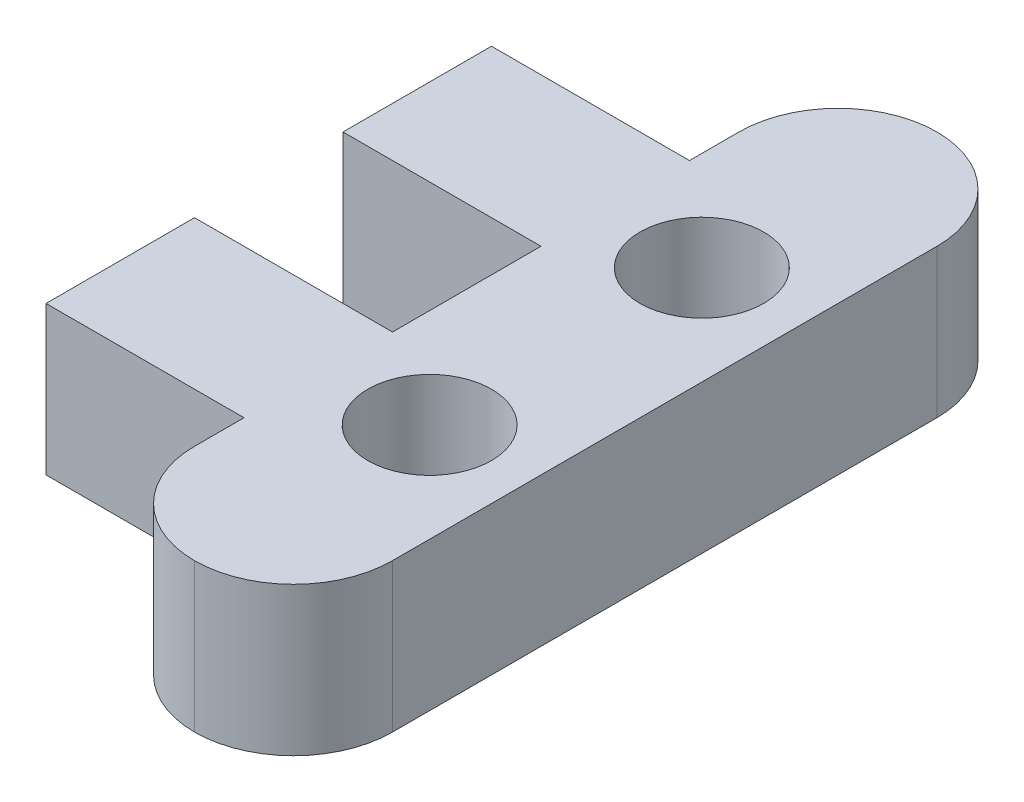
ISO-10303-21;
HEADER;
FILE_DESCRIPTION(('STEP AP214'),'2;1');
FILE_NAME('part.step','',(''),(''),'','','');
FILE_SCHEMA(('AUTOMOTIVE_DESIGN { 1 0 10303 214 1 1 1 1 }'));
ENDSEC;
DATA;
#1=APPLICATION_CONTEXT('core data for automotive mechanical design processes');
#2=APPLICATION_PROTOCOL_DEFINITION('international standard','automotive_design',2000,#1);
#3=PRODUCT_CONTEXT('',#1,'mechanical');
#4=PRODUCT('Part','Part','',(#3));
#5=PRODUCT_RELATED_PRODUCT_CATEGORY('part','',(#4));
#6=PRODUCT_DEFINITION_FORMATION('','',#4);
#7=PRODUCT_DEFINITION_CONTEXT('part definition',#1,'design');
#8=PRODUCT_DEFINITION('design','',#6,#7);
#9=PRODUCT_DEFINITION_SHAPE('','',#8);
#10=(LENGTH_UNIT() NAMED_UNIT(*) SI_UNIT(.MILLI.,.METRE.));
#11=(NAMED_UNIT(*) PLANE_ANGLE_UNIT() SI_UNIT($,.RADIAN.));
#12=(NAMED_UNIT(*) SI_UNIT($,.STERADIAN.) SOLID_ANGLE_UNIT());
#13=UNCERTAINTY_MEASURE_WITH_UNIT(LENGTH_MEASURE(1.E-05),#10,'distance_accuracy_value','');
#14=(GEOMETRIC_REPRESENTATION_CONTEXT(3) GLOBAL_UNCERTAINTY_ASSIGNED_CONTEXT((#13)) GLOBAL_UNIT_ASSIGNED_CONTEXT((#10,
#11,#12)) REPRESENTATION_CONTEXT('',''));
#15=CARTESIAN_POINT('',(0.,0.,0.));
#16=DIRECTION('',(0.,0.,1.));
#17=DIRECTION('',(1.,0.,0.));
#18=AXIS2_PLACEMENT_3D('',#15,#16,#17);
#19=CARTESIAN_POINT('',(0.,6.,0.));
#20=DIRECTION('',(0.,1.,0.));
#21=DIRECTION('',(0.,0.,1.));
#22=AXIS2_PLACEMENT_3D('',#19,#20,#21);
#23=PLANE('',#22);
#24=CARTESIAN_POINT('',(0.,6.,-5.5));
#25=DIRECTION('',(0.,1.,0.));
#26=DIRECTION('',(0.,0.,1.));
#27=AXIS2_PLACEMENT_3D('',#24,#25,#26);
#28=CIRCLE('',#27,2.5);
#29=CARTESIAN_POINT('',(0.,6.,-3.));
#30=VERTEX_POINT('',#29);
#31=EDGE_CURVE('E180',#30,#30,#28,.T.);
#32=ORIENTED_EDGE('',*,*,#31,.F.);
#33=EDGE_LOOP('',(#32));
#34=FACE_BOUND('',#33,.T.);
#35=CARTESIAN_POINT('',(0.,6.,11.0000096059392));
#36=DIRECTION('',(0.,1.,0.));
#37=DIRECTION('',(0.,0.,1.));
#38=AXIS2_PLACEMENT_3D('',#35,#36,#37);
#39=CIRCLE('',#38,4.);
#40=CARTESIAN_POINT('',(-4.,6.,11.0000096059392));
#41=VERTEX_POINT('',#40);
#42=CARTESIAN_POINT('',(0.,6.,15.0000096059392));
#43=VERTEX_POINT('',#42);
#44=EDGE_CURVE('E50',#41,#43,#39,.T.);
#45=ORIENTED_EDGE('',*,*,#44,.T.);
#46=CARTESIAN_POINT('',(0.,6.,11.0000096059392));
#47=DIRECTION('',(0.,1.,0.));
#48=DIRECTION('',(0.,0.,1.));
#49=AXIS2_PLACEMENT_3D('',#46,#47,#48);
#50=CIRCLE('',#49,4.);
#51=CARTESIAN_POINT('',(4.,6.,11.0000096059392));
#52=VERTEX_POINT('',#51);
#53=EDGE_CURVE('E233',#43,#52,#50,.T.);
#54=ORIENTED_EDGE('',*,*,#53,.T.);
#55=DIRECTION('',(0.,0.,-1.));
#56=VECTOR('',#55,1.);
#57=CARTESIAN_POINT('',(4.,6.,-14.9999903940608));
#58=LINE('',#57,#56);
#59=CARTESIAN_POINT('',(4.,6.,-10.9999903940608));
#60=VERTEX_POINT('',#59);
#61=EDGE_CURVE('E144',#52,#60,#58,.T.);
#62=ORIENTED_EDGE('',*,*,#61,.T.);
#63=CARTESIAN_POINT('',(0.,6.,-10.9999903940608));
#64=DIRECTION('',(0.,1.,0.));
#65=DIRECTION('',(0.,0.,1.));
#66=AXIS2_PLACEMENT_3D('',#63,#64,#65);
#67=CIRCLE('',#66,4.);
#68=CARTESIAN_POINT('',(0.,6.,-14.9999903940608));
#69=VERTEX_POINT('',#68);
#70=EDGE_CURVE('E230',#60,#69,#67,.T.);
#71=ORIENTED_EDGE('',*,*,#70,.T.);
#72=CARTESIAN_POINT('',(0.,6.,-10.9999903940608));
#73=DIRECTION('',(0.,1.,0.));
#74=DIRECTION('',(0.,0.,1.));
#75=AXIS2_PLACEMENT_3D('',#72,#73,#74);
#76=CIRCLE('',#75,4.);
#77=CARTESIAN_POINT('',(-4.,6.,-10.9999903940608));
#78=VERTEX_POINT('',#77);
#79=EDGE_CURVE('E141',#69,#78,#76,.T.);
#80=ORIENTED_EDGE('',*,*,#79,.T.);
#81=DIRECTION('',(0.,0.,1.));
#82=VECTOR('',#81,1.);
#83=CARTESIAN_POINT('',(-4.,6.,-14.9999903940608));
#84=LINE('',#83,#82);
#85=CARTESIAN_POINT('',(-4.,6.,-8.99999039406083));
#86=VERTEX_POINT('',#85);
#87=EDGE_CURVE('E134',#78,#86,#84,.T.);
#88=ORIENTED_EDGE('',*,*,#87,.T.);
#89=DIRECTION('',(-1.,0.,0.));
#90=VECTOR('',#89,1.);
#91=CARTESIAN_POINT('',(-4.,6.,-8.99999039406083));
#92=LINE('',#91,#90);
#93=CARTESIAN_POINT('',(-12.,6.,-8.99999039406083));
#94=VERTEX_POINT('',#93);
#95=EDGE_CURVE('E138',#86,#94,#92,.T.);
#96=ORIENTED_EDGE('',*,*,#95,.T.);
#97=DIRECTION('',(0.,0.,1.));
#98=VECTOR('',#97,1.);
#99=CARTESIAN_POINT('',(-12.,6.,-8.99999039406083));
#100=LINE('',#99,#98);
#101=CARTESIAN_POINT('',(-12.,6.,-2.99999039406083));
#102=VERTEX_POINT('',#101);
#103=EDGE_CURVE('E159',#94,#102,#100,.T.);
#104=ORIENTED_EDGE('',*,*,#103,.T.);
#105=DIRECTION('',(1.,0.,0.));
#106=VECTOR('',#105,1.);
#107=CARTESIAN_POINT('',(-4.,6.,-2.99999039406083));
#108=LINE('',#107,#106);
#109=CARTESIAN_POINT('',(-4.,6.,-2.99999039406083));
#110=VERTEX_POINT('',#109);
#111=EDGE_CURVE('E161',#102,#110,#108,.T.);
#112=ORIENTED_EDGE('',*,*,#111,.T.);
#113=DIRECTION('',(0.,0.,1.));
#114=VECTOR('',#113,1.);
#115=CARTESIAN_POINT('',(-4.,6.,3.00000960593917));
#116=LINE('',#115,#114);
#117=CARTESIAN_POINT('',(-4.,6.,3.00000960593917));
#118=VERTEX_POINT('',#117);
#119=EDGE_CURVE('E166',#110,#118,#116,.T.);
#120=ORIENTED_EDGE('',*,*,#119,.T.);
#121=DIRECTION('',(-1.,0.,0.));
#122=VECTOR('',#121,1.);
#123=CARTESIAN_POINT('',(-12.,6.,3.00000960593917));
#124=LINE('',#123,#122);
#125=CARTESIAN_POINT('',(-12.,6.,3.00000960593917));
#126=VERTEX_POINT('',#125);
#127=EDGE_CURVE('E168',#118,#126,#124,.T.);
#128=ORIENTED_EDGE('',*,*,#127,.T.);
#129=DIRECTION('',(0.,0.,1.));
#130=VECTOR('',#129,1.);
#131=CARTESIAN_POINT('',(-12.,6.,3.00000960593917));
#132=LINE('',#131,#130);
#133=CARTESIAN_POINT('',(-12.,6.,9.00000960593917));
#134=VERTEX_POINT('',#133);
#135=EDGE_CURVE('E170',#126,#134,#132,.T.);
#136=ORIENTED_EDGE('',*,*,#135,.T.);
#137=DIRECTION('',(1.,0.,0.));
#138=VECTOR('',#137,1.);
#139=CARTESIAN_POINT('',(-4.,6.,9.00000960593917));
#140=LINE('',#139,#138);
#141=CARTESIAN_POINT('',(-4.,6.,9.00000960593917));
#142=VERTEX_POINT('',#141);
#143=EDGE_CURVE('E172',#134,#142,#140,.T.);
#144=ORIENTED_EDGE('',*,*,#143,.T.);
#145=DIRECTION('',(0.,0.,1.));
#146=VECTOR('',#145,1.);
#147=CARTESIAN_POINT('',(-4.,6.,9.00000960593917));
#148=LINE('',#147,#146);
#149=EDGE_CURVE('E174',#142,#41,#148,.T.);
#150=ORIENTED_EDGE('',*,*,#149,.T.);
#151=EDGE_LOOP('',(#45,#54,#62,#71,#80,#88,#96,#104,#112,#120,#128,#136,#144,#150));
#152=FACE_BOUND('',#151,.T.);
#153=CARTESIAN_POINT('',(0.,6.,5.5));
#154=DIRECTION('',(0.,1.,0.));
#155=DIRECTION('',(0.,0.,1.));
#156=AXIS2_PLACEMENT_3D('',#153,#154,#155);
#157=CIRCLE('',#156,2.5);
#158=CARTESIAN_POINT('',(0.,6.,8.));
#159=VERTEX_POINT('',#158);
#160=EDGE_CURVE('E241',#159,#159,#157,.T.);
#161=ORIENTED_EDGE('',*,*,#160,.F.);
#162=EDGE_LOOP('',(#161));
#163=FACE_BOUND('',#162,.T.);
#164=ADVANCED_FACE('F33',(#34,#152,#163),#23,.T.);
#165=CARTESIAN_POINT('',(0.,0.,0.));
#166=DIRECTION('',(0.,1.,0.));
#167=DIRECTION('',(0.,0.,1.));
#168=AXIS2_PLACEMENT_3D('',#165,#166,#167);
#169=PLANE('',#168);
#170=DIRECTION('',(0.,0.,-1.));
#171=VECTOR('',#170,1.);
#172=CARTESIAN_POINT('',(4.,0.,-14.9999903940608));
#173=LINE('',#172,#171);
#174=CARTESIAN_POINT('',(4.,0.,11.0000096059392));
#175=VERTEX_POINT('',#174);
#176=CARTESIAN_POINT('',(4.,0.,-10.9999903940608));
#177=VERTEX_POINT('',#176);
#178=EDGE_CURVE('E177',#175,#177,#173,.T.);
#179=ORIENTED_EDGE('',*,*,#178,.F.);
#180=CARTESIAN_POINT('',(0.,0.,11.0000096059392));
#181=DIRECTION('',(0.,1.,0.));
#182=DIRECTION('',(0.,0.,1.));
#183=AXIS2_PLACEMENT_3D('',#180,#181,#182);
#184=CIRCLE('',#183,4.);
#185=CARTESIAN_POINT('',(0.,0.,15.0000096059392));
#186=VERTEX_POINT('',#185);
#187=EDGE_CURVE('E227',#175,#186,#184,.F.);
#188=ORIENTED_EDGE('',*,*,#187,.T.);
#189=CARTESIAN_POINT('',(0.,0.,11.0000096059392));
#190=DIRECTION('',(0.,1.,0.));
#191=DIRECTION('',(0.,0.,1.));
#192=AXIS2_PLACEMENT_3D('',#189,#190,#191);
#193=CIRCLE('',#192,4.);
#194=CARTESIAN_POINT('',(-4.,0.,11.0000096059392));
#195=VERTEX_POINT('',#194);
#196=EDGE_CURVE('E225',#186,#195,#193,.F.);
#197=ORIENTED_EDGE('',*,*,#196,.T.);
#198=DIRECTION('',(0.,0.,1.));
#199=VECTOR('',#198,1.);
#200=CARTESIAN_POINT('',(-4.,0.,9.00000960593917));
#201=LINE('',#200,#199);
#202=CARTESIAN_POINT('',(-4.,0.,9.00000960593917));
#203=VERTEX_POINT('',#202);
#204=EDGE_CURVE('E196',#203,#195,#201,.T.);
#205=ORIENTED_EDGE('',*,*,#204,.F.);
#206=DIRECTION('',(1.,0.,0.));
#207=VECTOR('',#206,1.);
#208=CARTESIAN_POINT('',(-4.,0.,9.00000960593917));
#209=LINE('',#208,#207);
#210=CARTESIAN_POINT('',(-12.,0.,9.00000960593917));
#211=VERTEX_POINT('',#210);
#212=EDGE_CURVE('E194',#211,#203,#209,.T.);
#213=ORIENTED_EDGE('',*,*,#212,.F.);
#214=DIRECTION('',(0.,0.,1.));
#215=VECTOR('',#214,1.);
#216=CARTESIAN_POINT('',(-12.,0.,3.00000960593917));
#217=LINE('',#216,#215);
#218=CARTESIAN_POINT('',(-12.,0.,3.00000960593917));
#219=VERTEX_POINT('',#218);
#220=EDGE_CURVE('E192',#219,#211,#217,.T.);
#221=ORIENTED_EDGE('',*,*,#220,.F.);
#222=DIRECTION('',(-1.,0.,0.));
#223=VECTOR('',#222,1.);
#224=CARTESIAN_POINT('',(-12.,0.,3.00000960593917));
#225=LINE('',#224,#223);
#226=CARTESIAN_POINT('',(-4.,0.,3.00000960593917));
#227=VERTEX_POINT('',#226);
#228=EDGE_CURVE('E190',#227,#219,#225,.T.);
#229=ORIENTED_EDGE('',*,*,#228,.F.);
#230=DIRECTION('',(0.,0.,1.));
#231=VECTOR('',#230,1.);
#232=CARTESIAN_POINT('',(-4.,0.,3.00000960593917));
#233=LINE('',#232,#231);
#234=CARTESIAN_POINT('',(-4.,0.,-2.99999039406083));
#235=VERTEX_POINT('',#234);
#236=EDGE_CURVE('E188',#235,#227,#233,.T.);
#237=ORIENTED_EDGE('',*,*,#236,.F.);
#238=DIRECTION('',(1.,0.,0.));
#239=VECTOR('',#238,1.);
#240=CARTESIAN_POINT('',(-4.,0.,-2.99999039406083));
#241=LINE('',#240,#239);
#242=CARTESIAN_POINT('',(-12.,0.,-2.99999039406083));
#243=VERTEX_POINT('',#242);
#244=EDGE_CURVE('E186',#243,#235,#241,.T.);
#245=ORIENTED_EDGE('',*,*,#244,.F.);
#246=DIRECTION('',(0.,0.,1.));
#247=VECTOR('',#246,1.);
#248=CARTESIAN_POINT('',(-12.,0.,-8.99999039406083));
#249=LINE('',#248,#247);
#250=CARTESIAN_POINT('',(-12.,0.,-8.99999039406083));
#251=VERTEX_POINT('',#250);
#252=EDGE_CURVE('E184',#251,#243,#249,.T.);
#253=ORIENTED_EDGE('',*,*,#252,.F.);
#254=DIRECTION('',(-1.,0.,0.));
#255=VECTOR('',#254,1.);
#256=CARTESIAN_POINT('',(-4.,0.,-8.99999039406083));
#257=LINE('',#256,#255);
#258=CARTESIAN_POINT('',(-4.,0.,-8.99999039406083));
#259=VERTEX_POINT('',#258);
#260=EDGE_CURVE('E182',#259,#251,#257,.T.);
#261=ORIENTED_EDGE('',*,*,#260,.F.);
#262=DIRECTION('',(0.,0.,1.));
#263=VECTOR('',#262,1.);
#264=CARTESIAN_POINT('',(-4.,0.,-14.9999903940608));
#265=LINE('',#264,#263);
#266=CARTESIAN_POINT('',(-4.,0.,-10.9999903940608));
#267=VERTEX_POINT('',#266);
#268=EDGE_CURVE('E150',#267,#259,#265,.T.);
#269=ORIENTED_EDGE('',*,*,#268,.F.);
#270=CARTESIAN_POINT('',(0.,0.,-10.9999903940608));
#271=DIRECTION('',(0.,1.,0.));
#272=DIRECTION('',(0.,0.,1.));
#273=AXIS2_PLACEMENT_3D('',#270,#271,#272);
#274=CIRCLE('',#273,4.);
#275=CARTESIAN_POINT('',(0.,0.,-14.9999903940608));
#276=VERTEX_POINT('',#275);
#277=EDGE_CURVE('E221',#267,#276,#274,.F.);
#278=ORIENTED_EDGE('',*,*,#277,.T.);
#279=CARTESIAN_POINT('',(0.,0.,-10.9999903940608));
#280=DIRECTION('',(0.,1.,0.));
#281=DIRECTION('',(0.,0.,1.));
#282=AXIS2_PLACEMENT_3D('',#279,#280,#281);
#283=CIRCLE('',#282,4.);
#284=EDGE_CURVE('E223',#276,#177,#283,.F.);
#285=ORIENTED_EDGE('',*,*,#284,.T.);
#286=EDGE_LOOP('',(#179,#188,#197,#205,#213,#221,#229,#237,#245,#253,#261,#269,#278,#285));
#287=FACE_BOUND('',#286,.T.);
#288=CARTESIAN_POINT('',(0.,0.,-5.5));
#289=DIRECTION('',(0.,1.,0.));
#290=DIRECTION('',(0.,0.,1.));
#291=AXIS2_PLACEMENT_3D('',#288,#289,#290);
#292=CIRCLE('',#291,2.5);
#293=CARTESIAN_POINT('',(0.,0.,-3.));
#294=VERTEX_POINT('',#293);
#295=EDGE_CURVE('E296',#294,#294,#292,.T.);
#296=ORIENTED_EDGE('',*,*,#295,.T.);
#297=EDGE_LOOP('',(#296));
#298=FACE_BOUND('',#297,.T.);
#299=CARTESIAN_POINT('',(0.,0.,5.5));
#300=DIRECTION('',(0.,1.,0.));
#301=DIRECTION('',(0.,0.,1.));
#302=AXIS2_PLACEMENT_3D('',#299,#300,#301);
#303=CIRCLE('',#302,2.5);
#304=CARTESIAN_POINT('',(0.,0.,8.));
#305=VERTEX_POINT('',#304);
#306=EDGE_CURVE('E237',#305,#305,#303,.T.);
#307=ORIENTED_EDGE('',*,*,#306,.T.);
#308=EDGE_LOOP('',(#307));
#309=FACE_BOUND('',#308,.T.);
#310=ADVANCED_FACE('F253',(#287,#298,#309),#169,.F.);
#311=CARTESIAN_POINT('',(4.,6.,-14.9999903940608));
#312=DIRECTION('',(-1.,0.,0.));
#313=DIRECTION('',(0.,0.,1.));
#314=AXIS2_PLACEMENT_3D('',#311,#312,#313);
#315=PLANE('',#314);
#316=ORIENTED_EDGE('',*,*,#61,.F.);
#317=DIRECTION('',(0.,-1.,0.));
#318=VECTOR('',#317,1.);
#319=CARTESIAN_POINT('',(4.,6.,11.0000096059392));
#320=LINE('',#319,#318);
#321=EDGE_CURVE('E218',#52,#175,#320,.T.);
#322=ORIENTED_EDGE('',*,*,#321,.T.);
#323=ORIENTED_EDGE('',*,*,#178,.T.);
#324=DIRECTION('',(0.,-1.,0.));
#325=VECTOR('',#324,1.);
#326=CARTESIAN_POINT('',(4.,6.,-10.9999903940608));
#327=LINE('',#326,#325);
#328=EDGE_CURVE('E153',#177,#60,#327,.F.);
#329=ORIENTED_EDGE('',*,*,#328,.T.);
#330=EDGE_LOOP('',(#316,#322,#323,#329));
#331=FACE_BOUND('',#330,.T.);
#332=ADVANCED_FACE('F294',(#331),#315,.F.);
#333=CARTESIAN_POINT('',(-4.,6.,-14.9999903940608));
#334=DIRECTION('',(1.,0.,0.));
#335=DIRECTION('',(0.,0.,-1.));
#336=AXIS2_PLACEMENT_3D('',#333,#334,#335);
#337=PLANE('',#336);
#338=ORIENTED_EDGE('',*,*,#87,.F.);
#339=DIRECTION('',(0.,-1.,0.));
#340=VECTOR('',#339,1.);
#341=CARTESIAN_POINT('',(-4.,6.,-10.9999903940608));
#342=LINE('',#341,#340);
#343=EDGE_CURVE('E11',#78,#267,#342,.T.);
#344=ORIENTED_EDGE('',*,*,#343,.T.);
#345=ORIENTED_EDGE('',*,*,#268,.T.);
#346=DIRECTION('',(0.,-1.,0.));
#347=VECTOR('',#346,1.);
#348=CARTESIAN_POINT('',(-4.,6.,-8.99999039406083));
#349=LINE('',#348,#347);
#350=EDGE_CURVE('E147',#86,#259,#349,.T.);
#351=ORIENTED_EDGE('',*,*,#350,.F.);
#352=EDGE_LOOP('',(#338,#344,#345,#351));
#353=FACE_BOUND('',#352,.T.);
#354=ADVANCED_FACE('F148',(#353),#337,.F.);
#355=CARTESIAN_POINT('',(-4.,6.,-8.99999039406083));
#356=DIRECTION('',(0.,0.,1.));
#357=DIRECTION('',(1.,0.,0.));
#358=AXIS2_PLACEMENT_3D('',#355,#356,#357);
#359=PLANE('',#358);
#360=ORIENTED_EDGE('',*,*,#260,.T.);
#361=DIRECTION('',(0.,-1.,0.));
#362=VECTOR('',#361,1.);
#363=CARTESIAN_POINT('',(-12.,6.,-8.99999039406083));
#364=LINE('',#363,#362);
#365=EDGE_CURVE('E154',#94,#251,#364,.T.);
#366=ORIENTED_EDGE('',*,*,#365,.F.);
#367=ORIENTED_EDGE('',*,*,#95,.F.);
#368=ORIENTED_EDGE('',*,*,#350,.T.);
#369=EDGE_LOOP('',(#360,#366,#367,#368));
#370=FACE_BOUND('',#369,.T.);
#371=ADVANCED_FACE('F156',(#370),#359,.F.);
#372=CARTESIAN_POINT('',(-12.,6.,-8.99999039406083));
#373=DIRECTION('',(1.,0.,0.));
#374=DIRECTION('',(0.,0.,-1.));
#375=AXIS2_PLACEMENT_3D('',#372,#373,#374);
#376=PLANE('',#375);
#377=ORIENTED_EDGE('',*,*,#252,.T.);
#378=DIRECTION('',(0.,-1.,0.));
#379=VECTOR('',#378,1.);
#380=CARTESIAN_POINT('',(-12.,6.,-2.99999039406083));
#381=LINE('',#380,#379);
#382=EDGE_CURVE('E212',#102,#243,#381,.T.);
#383=ORIENTED_EDGE('',*,*,#382,.F.);
#384=ORIENTED_EDGE('',*,*,#103,.F.);
#385=ORIENTED_EDGE('',*,*,#365,.T.);
#386=EDGE_LOOP('',(#377,#383,#384,#385));
#387=FACE_BOUND('',#386,.T.);
#388=ADVANCED_FACE('F258',(#387),#376,.F.);
#389=CARTESIAN_POINT('',(-4.,6.,-2.99999039406083));
#390=DIRECTION('',(0.,0.,-1.));
#391=DIRECTION('',(-1.,0.,0.));
#392=AXIS2_PLACEMENT_3D('',#389,#390,#391);
#393=PLANE('',#392);
#394=ORIENTED_EDGE('',*,*,#244,.T.);
#395=DIRECTION('',(0.,-1.,0.));
#396=VECTOR('',#395,1.);
#397=CARTESIAN_POINT('',(-4.,6.,-2.99999039406083));
#398=LINE('',#397,#396);
#399=EDGE_CURVE('E209',#110,#235,#398,.T.);
#400=ORIENTED_EDGE('',*,*,#399,.F.);
#401=ORIENTED_EDGE('',*,*,#111,.F.);
#402=ORIENTED_EDGE('',*,*,#382,.T.);
#403=EDGE_LOOP('',(#394,#400,#401,#402));
#404=FACE_BOUND('',#403,.T.);
#405=ADVANCED_FACE('F265',(#404),#393,.F.);
#406=CARTESIAN_POINT('',(-4.,6.,3.00000960593917));
#407=DIRECTION('',(1.,0.,0.));
#408=DIRECTION('',(0.,0.,-1.));
#409=AXIS2_PLACEMENT_3D('',#406,#407,#408);
#410=PLANE('',#409);
#411=ORIENTED_EDGE('',*,*,#236,.T.);
#412=DIRECTION('',(0.,-1.,0.));
#413=VECTOR('',#412,1.);
#414=CARTESIAN_POINT('',(-4.,6.,3.00000960593917));
#415=LINE('',#414,#413);
#416=EDGE_CURVE('E206',#118,#227,#415,.T.);
#417=ORIENTED_EDGE('',*,*,#416,.F.);
#418=ORIENTED_EDGE('',*,*,#119,.F.);
#419=ORIENTED_EDGE('',*,*,#399,.T.);
#420=EDGE_LOOP('',(#411,#417,#418,#419));
#421=FACE_BOUND('',#420,.T.);
#422=ADVANCED_FACE('F268',(#421),#410,.F.);
#423=CARTESIAN_POINT('',(-12.,6.,3.00000960593917));
#424=DIRECTION('',(0.,0.,1.));
#425=DIRECTION('',(1.,0.,0.));
#426=AXIS2_PLACEMENT_3D('',#423,#424,#425);
#427=PLANE('',#426);
#428=ORIENTED_EDGE('',*,*,#228,.T.);
#429=DIRECTION('',(0.,-1.,0.));
#430=VECTOR('',#429,1.);
#431=CARTESIAN_POINT('',(-12.,6.,3.00000960593917));
#432=LINE('',#431,#430);
#433=EDGE_CURVE('E203',#126,#219,#432,.T.);
#434=ORIENTED_EDGE('',*,*,#433,.F.);
#435=ORIENTED_EDGE('',*,*,#127,.F.);
#436=ORIENTED_EDGE('',*,*,#416,.T.);
#437=EDGE_LOOP('',(#428,#434,#435,#436));
#438=FACE_BOUND('',#437,.T.);
#439=ADVANCED_FACE('F273',(#438),#427,.F.);
#440=CARTESIAN_POINT('',(-12.,6.,3.00000960593917));
#441=DIRECTION('',(1.,0.,0.));
#442=DIRECTION('',(0.,0.,-1.));
#443=AXIS2_PLACEMENT_3D('',#440,#441,#442);
#444=PLANE('',#443);
#445=ORIENTED_EDGE('',*,*,#220,.T.);
#446=DIRECTION('',(0.,-1.,0.));
#447=VECTOR('',#446,1.);
#448=CARTESIAN_POINT('',(-12.,6.,9.00000960593917));
#449=LINE('',#448,#447);
#450=EDGE_CURVE('E200',#134,#211,#449,.T.);
#451=ORIENTED_EDGE('',*,*,#450,.F.);
#452=ORIENTED_EDGE('',*,*,#135,.F.);
#453=ORIENTED_EDGE('',*,*,#433,.T.);
#454=EDGE_LOOP('',(#445,#451,#452,#453));
#455=FACE_BOUND('',#454,.T.);
#456=ADVANCED_FACE('F279',(#455),#444,.F.);
#457=CARTESIAN_POINT('',(-4.,6.,9.00000960593917));
#458=DIRECTION('',(0.,0.,-1.));
#459=DIRECTION('',(-1.,0.,0.));
#460=AXIS2_PLACEMENT_3D('',#457,#458,#459);
#461=PLANE('',#460);
#462=ORIENTED_EDGE('',*,*,#212,.T.);
#463=DIRECTION('',(0.,-1.,0.));
#464=VECTOR('',#463,1.);
#465=CARTESIAN_POINT('',(-4.,6.,9.00000960593917));
#466=LINE('',#465,#464);
#467=EDGE_CURVE('E176',#142,#203,#466,.T.);
#468=ORIENTED_EDGE('',*,*,#467,.F.);
#469=ORIENTED_EDGE('',*,*,#143,.F.);
#470=ORIENTED_EDGE('',*,*,#450,.T.);
#471=EDGE_LOOP('',(#462,#468,#469,#470));
#472=FACE_BOUND('',#471,.T.);
#473=ADVANCED_FACE('F283',(#472),#461,.F.);
#474=CARTESIAN_POINT('',(-4.,6.,9.00000960593917));
#475=DIRECTION('',(1.,0.,0.));
#476=DIRECTION('',(0.,0.,-1.));
#477=AXIS2_PLACEMENT_3D('',#474,#475,#476);
#478=PLANE('',#477);
#479=ORIENTED_EDGE('',*,*,#204,.T.);
#480=DIRECTION('',(0.,-1.,0.));
#481=VECTOR('',#480,1.);
#482=CARTESIAN_POINT('',(-4.,6.,11.0000096059392));
#483=LINE('',#482,#481);
#484=EDGE_CURVE('E42',#195,#41,#483,.F.);
#485=ORIENTED_EDGE('',*,*,#484,.T.);
#486=ORIENTED_EDGE('',*,*,#149,.F.);
#487=ORIENTED_EDGE('',*,*,#467,.T.);
#488=EDGE_LOOP('',(#479,#485,#486,#487));
#489=FACE_BOUND('',#488,.T.);
#490=ADVANCED_FACE('F285',(#489),#478,.F.);
#491=CARTESIAN_POINT('',(0.,6.,-5.5));
#492=DIRECTION('',(0.,-1.,0.));
#493=DIRECTION('',(0.,0.,-1.));
#494=AXIS2_PLACEMENT_3D('',#491,#492,#493);
#495=CYLINDRICAL_SURFACE('',#494,2.5);
#496=ORIENTED_EDGE('',*,*,#31,.T.);
#497=EDGE_LOOP('',(#496));
#498=FACE_BOUND('',#497,.T.);
#499=ORIENTED_EDGE('',*,*,#295,.F.);
#500=EDGE_LOOP('',(#499));
#501=FACE_BOUND('',#500,.T.);
#502=ADVANCED_FACE('F315',(#498,#501),#495,.F.);
#503=CARTESIAN_POINT('',(0.,6.,5.5));
#504=DIRECTION('',(0.,-1.,0.));
#505=DIRECTION('',(0.,0.,-1.));
#506=AXIS2_PLACEMENT_3D('',#503,#504,#505);
#507=CYLINDRICAL_SURFACE('',#506,2.5);
#508=ORIENTED_EDGE('',*,*,#160,.T.);
#509=EDGE_LOOP('',(#508));
#510=FACE_BOUND('',#509,.T.);
#511=ORIENTED_EDGE('',*,*,#306,.F.);
#512=EDGE_LOOP('',(#511));
#513=FACE_BOUND('',#512,.T.);
#514=ADVANCED_FACE('F304',(#510,#513),#507,.F.);
#515=CARTESIAN_POINT('',(0.,6.,11.0000096059392));
#516=DIRECTION('',(0.,-1.,0.));
#517=DIRECTION('',(0.,0.,-1.));
#518=AXIS2_PLACEMENT_3D('',#515,#516,#517);
#519=CYLINDRICAL_SURFACE('',#518,4.);
#520=DIRECTION('',(0.,-1.,0.));
#521=VECTOR('',#520,1.);
#522=CARTESIAN_POINT('',(0.,6.,15.0000096059392));
#523=LINE('',#522,#521);
#524=EDGE_CURVE('E235',#43,#186,#523,.T.);
#525=ORIENTED_EDGE('',*,*,#524,.F.);
#526=ORIENTED_EDGE('',*,*,#44,.F.);
#527=ORIENTED_EDGE('',*,*,#484,.F.);
#528=ORIENTED_EDGE('',*,*,#196,.F.);
#529=EDGE_LOOP('',(#525,#526,#527,#528));
#530=FACE_BOUND('',#529,.T.);
#531=ADVANCED_FACE('F287',(#530),#519,.T.);
#532=CARTESIAN_POINT('',(0.,6.,11.0000096059392));
#533=DIRECTION('',(0.,-1.,0.));
#534=DIRECTION('',(0.,0.,-1.));
#535=AXIS2_PLACEMENT_3D('',#532,#533,#534);
#536=CYLINDRICAL_SURFACE('',#535,4.);
#537=ORIENTED_EDGE('',*,*,#53,.F.);
#538=ORIENTED_EDGE('',*,*,#524,.T.);
#539=ORIENTED_EDGE('',*,*,#187,.F.);
#540=ORIENTED_EDGE('',*,*,#321,.F.);
#541=EDGE_LOOP('',(#537,#538,#539,#540));
#542=FACE_BOUND('',#541,.T.);
#543=ADVANCED_FACE('F290',(#542),#536,.T.);
#544=CARTESIAN_POINT('',(0.,6.,-10.9999903940608));
#545=DIRECTION('',(0.,-1.,0.));
#546=DIRECTION('',(0.,0.,-1.));
#547=AXIS2_PLACEMENT_3D('',#544,#545,#546);
#548=CYLINDRICAL_SURFACE('',#547,4.);
#549=ORIENTED_EDGE('',*,*,#343,.F.);
#550=ORIENTED_EDGE('',*,*,#79,.F.);
#551=DIRECTION('',(0.,-1.,0.));
#552=VECTOR('',#551,1.);
#553=CARTESIAN_POINT('',(0.,6.,-14.9999903940608));
#554=LINE('',#553,#552);
#555=EDGE_CURVE('E37',#276,#69,#554,.F.);
#556=ORIENTED_EDGE('',*,*,#555,.F.);
#557=ORIENTED_EDGE('',*,*,#277,.F.);
#558=EDGE_LOOP('',(#549,#550,#556,#557));
#559=FACE_BOUND('',#558,.T.);
#560=ADVANCED_FACE('F35',(#559),#548,.T.);
#561=CARTESIAN_POINT('',(0.,6.,-10.9999903940608));
#562=DIRECTION('',(0.,-1.,0.));
#563=DIRECTION('',(0.,0.,-1.));
#564=AXIS2_PLACEMENT_3D('',#561,#562,#563);
#565=CYLINDRICAL_SURFACE('',#564,4.);
#566=ORIENTED_EDGE('',*,*,#70,.F.);
#567=ORIENTED_EDGE('',*,*,#328,.F.);
#568=ORIENTED_EDGE('',*,*,#284,.F.);
#569=ORIENTED_EDGE('',*,*,#555,.T.);
#570=EDGE_LOOP('',(#566,#567,#568,#569));
#571=FACE_BOUND('',#570,.T.);
#572=ADVANCED_FACE('F247',(#571),#565,.T.);
#573=CLOSED_SHELL('',(#164,#310,#332,#354,#371,#388,#405,#422,#439,#456,#473,#490,#502,#514,
#531,#543,#560,#572));
#574=MANIFOLD_SOLID_BREP('B2',#573);
#575=ADVANCED_BREP_SHAPE_REPRESENTATION('',(#18,#574),#14);
#576=SHAPE_DEFINITION_REPRESENTATION(#9,#575);
ENDSEC;
END-ISO-10303-21;
